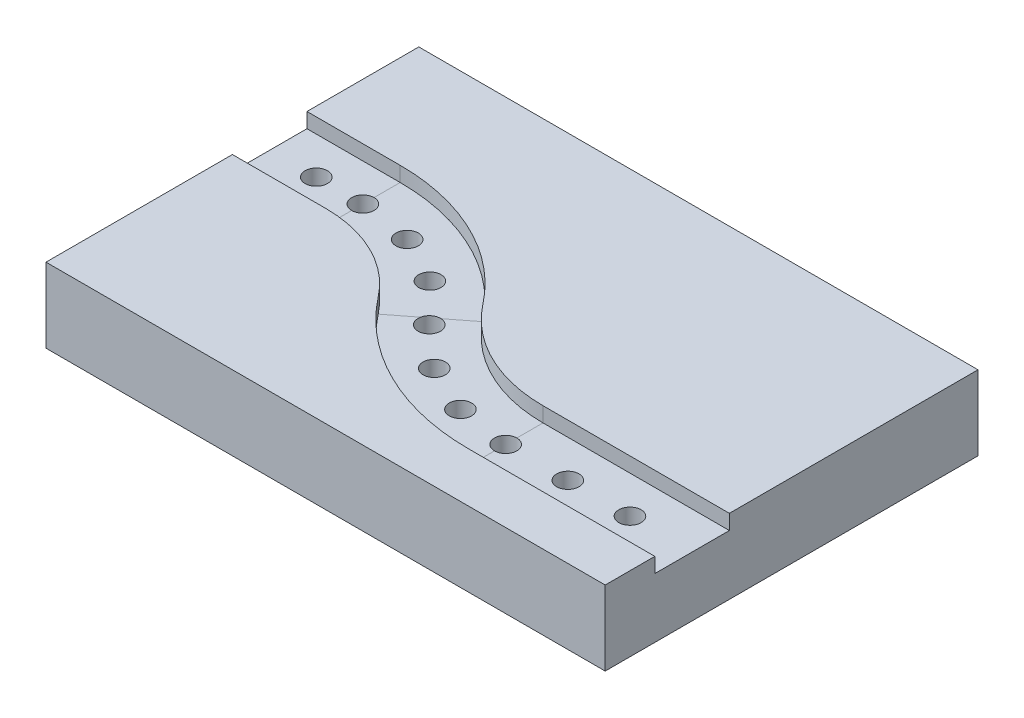
ISO-10303-21;
HEADER;
FILE_DESCRIPTION(('STEP AP214'),'2;1');
FILE_NAME('part.step','',(''),(''),'','','');
FILE_SCHEMA(('AUTOMOTIVE_DESIGN { 1 0 10303 214 1 1 1 1 }'));
ENDSEC;
DATA;
#1=APPLICATION_CONTEXT('core data for automotive mechanical design processes');
#2=APPLICATION_PROTOCOL_DEFINITION('international standard','automotive_design',2000,#1);
#3=PRODUCT_CONTEXT('',#1,'mechanical');
#4=PRODUCT('Part','Part','',(#3));
#5=PRODUCT_RELATED_PRODUCT_CATEGORY('part','',(#4));
#6=PRODUCT_DEFINITION_FORMATION('','',#4);
#7=PRODUCT_DEFINITION_CONTEXT('part definition',#1,'design');
#8=PRODUCT_DEFINITION('design','',#6,#7);
#9=PRODUCT_DEFINITION_SHAPE('','',#8);
#10=(LENGTH_UNIT() NAMED_UNIT(*) SI_UNIT(.MILLI.,.METRE.));
#11=(NAMED_UNIT(*) PLANE_ANGLE_UNIT() SI_UNIT($,.RADIAN.));
#12=(NAMED_UNIT(*) SI_UNIT($,.STERADIAN.) SOLID_ANGLE_UNIT());
#13=UNCERTAINTY_MEASURE_WITH_UNIT(LENGTH_MEASURE(1.E-05),#10,'distance_accuracy_value','');
#14=(GEOMETRIC_REPRESENTATION_CONTEXT(3) GLOBAL_UNCERTAINTY_ASSIGNED_CONTEXT((#13)) GLOBAL_UNIT_ASSIGNED_CONTEXT((#10,
#11,#12)) REPRESENTATION_CONTEXT('',''));
#15=CARTESIAN_POINT('',(0.,0.,0.));
#16=DIRECTION('',(0.,0.,1.));
#17=DIRECTION('',(1.,0.,0.));
#18=AXIS2_PLACEMENT_3D('',#15,#16,#17);
#19=CARTESIAN_POINT('',(0.,20.,0.));
#20=DIRECTION('',(0.,1.,0.));
#21=DIRECTION('',(0.,0.,1.));
#22=AXIS2_PLACEMENT_3D('',#19,#20,#21);
#23=PLANE('',#22);
#24=DIRECTION('',(0.,0.,-1.));
#25=VECTOR('',#24,1.);
#26=CARTESIAN_POINT('',(0.,20.,0.));
#27=LINE('',#26,#25);
#28=CARTESIAN_POINT('',(0.,20.,-70.));
#29=VERTEX_POINT('',#28);
#30=CARTESIAN_POINT('',(0.,20.,-100.));
#31=VERTEX_POINT('',#30);
#32=EDGE_CURVE('E265',#29,#31,#27,.T.);
#33=ORIENTED_EDGE('',*,*,#32,.F.);
#34=DIRECTION('',(1.,0.,0.));
#35=VECTOR('',#34,1.);
#36=CARTESIAN_POINT('',(0.,20.,-70.));
#37=LINE('',#36,#35);
#38=CARTESIAN_POINT('',(25.,20.,-70.));
#39=VERTEX_POINT('',#38);
#40=EDGE_CURVE('E74',#29,#39,#37,.T.);
#41=ORIENTED_EDGE('',*,*,#40,.T.);
#42=CARTESIAN_POINT('',(25.,20.,-15.));
#43=DIRECTION('',(0.,1.,0.));
#44=DIRECTION('',(0.,0.,1.));
#45=AXIS2_PLACEMENT_3D('',#42,#43,#44);
#46=CIRCLE('',#45,55.);
#47=CARTESIAN_POINT('',(68.4210526315789,20.,-48.7581425491043));
#48=VERTEX_POINT('',#47);
#49=EDGE_CURVE('E307',#39,#48,#46,.F.);
#50=ORIENTED_EDGE('',*,*,#49,.T.);
#51=CARTESIAN_POINT('',(100.,20.,-73.3095189484529));
#52=DIRECTION('',(0.,1.,0.));
#53=DIRECTION('',(0.,0.,1.));
#54=AXIS2_PLACEMENT_3D('',#51,#52,#53);
#55=CIRCLE('',#54,40.);
#56=CARTESIAN_POINT('',(100.,20.,-33.309518948453));
#57=VERTEX_POINT('',#56);
#58=EDGE_CURVE('E305',#48,#57,#55,.T.);
#59=ORIENTED_EDGE('',*,*,#58,.T.);
#60=DIRECTION('',(1.,0.,0.));
#61=VECTOR('',#60,1.);
#62=CARTESIAN_POINT('',(0.,20.,-33.309518948453));
#63=LINE('',#62,#61);
#64=CARTESIAN_POINT('',(150.,20.,-33.309518948453));
#65=VERTEX_POINT('',#64);
#66=EDGE_CURVE('E302',#57,#65,#63,.T.);
#67=ORIENTED_EDGE('',*,*,#66,.T.);
#68=DIRECTION('',(0.,0.,-1.));
#69=VECTOR('',#68,1.);
#70=CARTESIAN_POINT('',(150.,20.,0.));
#71=LINE('',#70,#69);
#72=CARTESIAN_POINT('',(150.,20.,-100.));
#73=VERTEX_POINT('',#72);
#74=EDGE_CURVE('E257',#65,#73,#71,.T.);
#75=ORIENTED_EDGE('',*,*,#74,.T.);
#76=DIRECTION('',(1.,0.,0.));
#77=VECTOR('',#76,1.);
#78=CARTESIAN_POINT('',(0.,20.,-100.));
#79=LINE('',#78,#77);
#80=EDGE_CURVE('E262',#31,#73,#79,.T.);
#81=ORIENTED_EDGE('',*,*,#80,.F.);
#82=EDGE_LOOP('',(#33,#41,#50,#59,#67,#75,#81));
#83=FACE_BOUND('',#82,.T.);
#84=ADVANCED_FACE('F70',(#83),#23,.T.);
#85=CARTESIAN_POINT('',(25.,20.,-15.));
#86=DIRECTION('',(0.,1.,0.));
#87=DIRECTION('',(0.,0.,1.));
#88=AXIS2_PLACEMENT_3D('',#85,#86,#87);
#89=CIRCLE('',#88,35.);
#90=CARTESIAN_POINT('',(52.6315789473684,20.,-36.48245434943));
#91=VERTEX_POINT('',#90);
#92=CARTESIAN_POINT('',(25.,20.,-50.));
#93=VERTEX_POINT('',#92);
#94=EDGE_CURVE('E296',#91,#93,#89,.T.);
#95=ORIENTED_EDGE('',*,*,#94,.T.);
#96=DIRECTION('',(-1.,0.,0.));
#97=VECTOR('',#96,1.);
#98=CARTESIAN_POINT('',(0.,20.,-50.));
#99=LINE('',#98,#97);
#100=CARTESIAN_POINT('',(0.,20.,-50.));
#101=VERTEX_POINT('',#100);
#102=EDGE_CURVE('E299',#93,#101,#99,.T.);
#103=ORIENTED_EDGE('',*,*,#102,.T.);
#104=CARTESIAN_POINT('',(0.,20.,0.));
#105=VERTEX_POINT('',#104);
#106=EDGE_CURVE('E266',#105,#101,#27,.T.);
#107=ORIENTED_EDGE('',*,*,#106,.F.);
#108=DIRECTION('',(1.,0.,0.));
#109=VECTOR('',#108,1.);
#110=CARTESIAN_POINT('',(0.,20.,0.));
#111=LINE('',#110,#109);
#112=CARTESIAN_POINT('',(150.,20.,0.));
#113=VERTEX_POINT('',#112);
#114=EDGE_CURVE('E254',#105,#113,#111,.T.);
#115=ORIENTED_EDGE('',*,*,#114,.T.);
#116=CARTESIAN_POINT('',(150.,20.,-13.309518948453));
#117=VERTEX_POINT('',#116);
#118=EDGE_CURVE('E259',#113,#117,#71,.T.);
#119=ORIENTED_EDGE('',*,*,#118,.T.);
#120=DIRECTION('',(-1.,0.,0.));
#121=VECTOR('',#120,1.);
#122=CARTESIAN_POINT('',(0.,20.,-13.309518948453));
#123=LINE('',#122,#121);
#124=CARTESIAN_POINT('',(100.,20.,-13.309518948453));
#125=VERTEX_POINT('',#124);
#126=EDGE_CURVE('E290',#117,#125,#123,.T.);
#127=ORIENTED_EDGE('',*,*,#126,.T.);
#128=CARTESIAN_POINT('',(100.,20.,-73.3095189484529));
#129=DIRECTION('',(0.,1.,0.));
#130=DIRECTION('',(0.,0.,1.));
#131=AXIS2_PLACEMENT_3D('',#128,#129,#130);
#132=CIRCLE('',#131,60.);
#133=EDGE_CURVE('E293',#125,#91,#132,.F.);
#134=ORIENTED_EDGE('',*,*,#133,.T.);
#135=EDGE_LOOP('',(#95,#103,#107,#115,#119,#127,#134));
#136=FACE_BOUND('',#135,.T.);
#137=ADVANCED_FACE('F374',(#136),#23,.T.);
#138=CARTESIAN_POINT('',(0.,20.,0.));
#139=DIRECTION('',(0.,0.,-1.));
#140=DIRECTION('',(-1.,0.,0.));
#141=AXIS2_PLACEMENT_3D('',#138,#139,#140);
#142=PLANE('',#141);
#143=DIRECTION('',(1.,0.,0.));
#144=VECTOR('',#143,1.);
#145=CARTESIAN_POINT('',(0.,0.,0.));
#146=LINE('',#145,#144);
#147=CARTESIAN_POINT('',(0.,0.,0.));
#148=VERTEX_POINT('',#147);
#149=CARTESIAN_POINT('',(150.,0.,0.));
#150=VERTEX_POINT('',#149);
#151=EDGE_CURVE('E270',#148,#150,#146,.T.);
#152=ORIENTED_EDGE('',*,*,#151,.T.);
#153=DIRECTION('',(0.,-1.,0.));
#154=VECTOR('',#153,1.);
#155=CARTESIAN_POINT('',(150.,20.,0.));
#156=LINE('',#155,#154);
#157=EDGE_CURVE('E287',#113,#150,#156,.T.);
#158=ORIENTED_EDGE('',*,*,#157,.F.);
#159=ORIENTED_EDGE('',*,*,#114,.F.);
#160=DIRECTION('',(0.,-1.,0.));
#161=VECTOR('',#160,1.);
#162=CARTESIAN_POINT('',(0.,20.,0.));
#163=LINE('',#162,#161);
#164=EDGE_CURVE('E269',#105,#148,#163,.T.);
#165=ORIENTED_EDGE('',*,*,#164,.T.);
#166=EDGE_LOOP('',(#152,#158,#159,#165));
#167=FACE_BOUND('',#166,.T.);
#168=ADVANCED_FACE('F72',(#167),#142,.F.);
#169=CARTESIAN_POINT('',(150.,20.,0.));
#170=DIRECTION('',(-1.,0.,0.));
#171=DIRECTION('',(0.,0.,1.));
#172=AXIS2_PLACEMENT_3D('',#169,#170,#171);
#173=PLANE('',#172);
#174=DIRECTION('',(0.,0.,1.));
#175=VECTOR('',#174,1.);
#176=CARTESIAN_POINT('',(150.,16.,-33.309518948453));
#177=LINE('',#176,#175);
#178=CARTESIAN_POINT('',(150.,16.,-33.309518948453));
#179=VERTEX_POINT('',#178);
#180=CARTESIAN_POINT('',(150.,16.,-13.309518948453));
#181=VERTEX_POINT('',#180);
#182=EDGE_CURVE('E357',#179,#181,#177,.T.);
#183=ORIENTED_EDGE('',*,*,#182,.T.);
#184=DIRECTION('',(0.,1.,0.));
#185=VECTOR('',#184,1.);
#186=CARTESIAN_POINT('',(150.,22.6475504867612,-13.309518948453));
#187=LINE('',#186,#185);
#188=EDGE_CURVE('E274',#181,#117,#187,.T.);
#189=ORIENTED_EDGE('',*,*,#188,.T.);
#190=ORIENTED_EDGE('',*,*,#118,.F.);
#191=ORIENTED_EDGE('',*,*,#157,.T.);
#192=DIRECTION('',(0.,0.,-1.));
#193=VECTOR('',#192,1.);
#194=CARTESIAN_POINT('',(150.,0.,0.));
#195=LINE('',#194,#193);
#196=CARTESIAN_POINT('',(150.,0.,-100.));
#197=VERTEX_POINT('',#196);
#198=EDGE_CURVE('E273',#150,#197,#195,.T.);
#199=ORIENTED_EDGE('',*,*,#198,.T.);
#200=DIRECTION('',(0.,-1.,0.));
#201=VECTOR('',#200,1.);
#202=CARTESIAN_POINT('',(150.,20.,-100.));
#203=LINE('',#202,#201);
#204=EDGE_CURVE('E285',#73,#197,#203,.T.);
#205=ORIENTED_EDGE('',*,*,#204,.F.);
#206=ORIENTED_EDGE('',*,*,#74,.F.);
#207=DIRECTION('',(0.,-1.,0.));
#208=VECTOR('',#207,1.);
#209=CARTESIAN_POINT('',(150.,22.6475504867612,-33.309518948453));
#210=LINE('',#209,#208);
#211=EDGE_CURVE('E244',#65,#179,#210,.T.);
#212=ORIENTED_EDGE('',*,*,#211,.T.);
#213=EDGE_LOOP('',(#183,#189,#190,#191,#199,#205,#206,#212));
#214=FACE_BOUND('',#213,.T.);
#215=ADVANCED_FACE('F363',(#214),#173,.F.);
#216=CARTESIAN_POINT('',(0.,20.,-100.));
#217=DIRECTION('',(0.,0.,-1.));
#218=DIRECTION('',(-1.,0.,0.));
#219=AXIS2_PLACEMENT_3D('',#216,#217,#218);
#220=PLANE('',#219);
#221=DIRECTION('',(1.,0.,0.));
#222=VECTOR('',#221,1.);
#223=CARTESIAN_POINT('',(0.,0.,-100.));
#224=LINE('',#223,#222);
#225=CARTESIAN_POINT('',(0.,0.,-100.));
#226=VERTEX_POINT('',#225);
#227=EDGE_CURVE('E277',#226,#197,#224,.T.);
#228=ORIENTED_EDGE('',*,*,#227,.F.);
#229=DIRECTION('',(0.,-1.,0.));
#230=VECTOR('',#229,1.);
#231=CARTESIAN_POINT('',(0.,20.,-100.));
#232=LINE('',#231,#230);
#233=EDGE_CURVE('E283',#31,#226,#232,.T.);
#234=ORIENTED_EDGE('',*,*,#233,.F.);
#235=ORIENTED_EDGE('',*,*,#80,.T.);
#236=ORIENTED_EDGE('',*,*,#204,.T.);
#237=EDGE_LOOP('',(#228,#234,#235,#236));
#238=FACE_BOUND('',#237,.T.);
#239=ADVANCED_FACE('F386',(#238),#220,.T.);
#240=CARTESIAN_POINT('',(0.,20.,0.));
#241=DIRECTION('',(-1.,0.,0.));
#242=DIRECTION('',(0.,0.,1.));
#243=AXIS2_PLACEMENT_3D('',#240,#241,#242);
#244=PLANE('',#243);
#245=DIRECTION('',(0.,-1.,0.));
#246=VECTOR('',#245,1.);
#247=CARTESIAN_POINT('',(0.,22.6475504867612,-70.));
#248=LINE('',#247,#246);
#249=CARTESIAN_POINT('',(0.,16.,-70.));
#250=VERTEX_POINT('',#249);
#251=EDGE_CURVE('E248',#29,#250,#248,.T.);
#252=ORIENTED_EDGE('',*,*,#251,.F.);
#253=ORIENTED_EDGE('',*,*,#32,.T.);
#254=ORIENTED_EDGE('',*,*,#233,.T.);
#255=DIRECTION('',(0.,0.,-1.));
#256=VECTOR('',#255,1.);
#257=CARTESIAN_POINT('',(0.,0.,0.));
#258=LINE('',#257,#256);
#259=EDGE_CURVE('E258',#148,#226,#258,.T.);
#260=ORIENTED_EDGE('',*,*,#259,.F.);
#261=ORIENTED_EDGE('',*,*,#164,.F.);
#262=ORIENTED_EDGE('',*,*,#106,.T.);
#263=DIRECTION('',(0.,1.,0.));
#264=VECTOR('',#263,1.);
#265=CARTESIAN_POINT('',(0.,22.6475504867612,-50.));
#266=LINE('',#265,#264);
#267=CARTESIAN_POINT('',(0.,16.,-50.));
#268=VERTEX_POINT('',#267);
#269=EDGE_CURVE('E242',#268,#101,#266,.T.);
#270=ORIENTED_EDGE('',*,*,#269,.F.);
#271=DIRECTION('',(0.,0.,1.));
#272=VECTOR('',#271,1.);
#273=CARTESIAN_POINT('',(0.,16.,-70.));
#274=LINE('',#273,#272);
#275=EDGE_CURVE('E245',#250,#268,#274,.T.);
#276=ORIENTED_EDGE('',*,*,#275,.F.);
#277=EDGE_LOOP('',(#252,#253,#254,#260,#261,#262,#270,#276));
#278=FACE_BOUND('',#277,.T.);
#279=ADVANCED_FACE('F320',(#278),#244,.T.);
#280=CARTESIAN_POINT('',(0.,0.,0.));
#281=DIRECTION('',(0.,1.,0.));
#282=DIRECTION('',(0.,0.,1.));
#283=AXIS2_PLACEMENT_3D('',#280,#281,#282);
#284=PLANE('',#283);
#285=CARTESIAN_POINT('',(116.666666666667,0.,-23.309518948453));
#286=DIRECTION('',(0.,1.,0.));
#287=DIRECTION('',(0.,0.,1.));
#288=AXIS2_PLACEMENT_3D('',#285,#286,#287);
#289=CIRCLE('',#288,2.99999999999999);
#290=CARTESIAN_POINT('',(116.666666666667,0.,-20.309518948453));
#291=VERTEX_POINT('',#290);
#292=EDGE_CURVE('E638',#291,#291,#289,.T.);
#293=ORIENTED_EDGE('',*,*,#292,.T.);
#294=EDGE_LOOP('',(#293));
#295=FACE_BOUND('',#294,.T.);
#296=CARTESIAN_POINT('',(133.333333333333,0.,-23.309518948453));
#297=DIRECTION('',(0.,1.,0.));
#298=DIRECTION('',(0.,0.,1.));
#299=AXIS2_PLACEMENT_3D('',#296,#297,#298);
#300=CIRCLE('',#299,2.99999999999998);
#301=CARTESIAN_POINT('',(133.333333333333,0.,-20.309518948453));
#302=VERTEX_POINT('',#301);
#303=EDGE_CURVE('E648',#302,#302,#300,.T.);
#304=ORIENTED_EDGE('',*,*,#303,.T.);
#305=EDGE_LOOP('',(#304));
#306=FACE_BOUND('',#305,.T.);
#307=CARTESIAN_POINT('',(12.5,0.,-60.));
#308=DIRECTION('',(0.,1.,0.));
#309=DIRECTION('',(0.,0.,1.));
#310=AXIS2_PLACEMENT_3D('',#307,#308,#309);
#311=CIRCLE('',#310,3.);
#312=CARTESIAN_POINT('',(12.5,0.,-57.));
#313=VERTEX_POINT('',#312);
#314=EDGE_CURVE('E651',#313,#313,#311,.T.);
#315=ORIENTED_EDGE('',*,*,#314,.T.);
#316=EDGE_LOOP('',(#315));
#317=FACE_BOUND('',#316,.T.);
#318=CARTESIAN_POINT('',(100.,0.,-23.309518948453));
#319=DIRECTION('',(0.,1.,0.));
#320=DIRECTION('',(0.,0.,1.));
#321=AXIS2_PLACEMENT_3D('',#318,#319,#320);
#322=CIRCLE('',#321,3.);
#323=CARTESIAN_POINT('',(100.,0.,-20.309518948453));
#324=VERTEX_POINT('',#323);
#325=EDGE_CURVE('E191',#324,#324,#322,.T.);
#326=ORIENTED_EDGE('',*,*,#325,.T.);
#327=EDGE_LOOP('',(#326));
#328=FACE_BOUND('',#327,.T.);
#329=CARTESIAN_POINT('',(85.7909951199552,0.,-25.3709730764841));
#330=DIRECTION('',(0.,1.,0.));
#331=DIRECTION('',(0.,0.,1.));
#332=AXIS2_PLACEMENT_3D('',#329,#330,#331);
#333=CIRCLE('',#332,3.);
#334=CARTESIAN_POINT('',(85.7909951199552,0.,-22.3709730764841));
#335=VERTEX_POINT('',#334);
#336=EDGE_CURVE('E661',#335,#335,#333,.T.);
#337=ORIENTED_EDGE('',*,*,#336,.T.);
#338=EDGE_LOOP('',(#337));
#339=FACE_BOUND('',#338,.T.);
#340=CARTESIAN_POINT('',(72.7536387105177,0.,-31.3853517356985));
#341=DIRECTION('',(0.,1.,0.));
#342=DIRECTION('',(0.,0.,1.));
#343=AXIS2_PLACEMENT_3D('',#340,#341,#342);
#344=CIRCLE('',#343,3.);
#345=CARTESIAN_POINT('',(72.7536387105177,0.,-28.3853517356985));
#346=VERTEX_POINT('',#345);
#347=EDGE_CURVE('E667',#346,#346,#344,.T.);
#348=ORIENTED_EDGE('',*,*,#347,.T.);
#349=EDGE_LOOP('',(#348));
#350=FACE_BOUND('',#349,.T.);
#351=CARTESIAN_POINT('',(61.9629672592415,0.,-40.8567202975129));
#352=DIRECTION('',(0.,1.,0.));
#353=DIRECTION('',(0.,0.,1.));
#354=AXIS2_PLACEMENT_3D('',#351,#352,#353);
#355=CIRCLE('',#354,3.);
#356=CARTESIAN_POINT('',(61.9629672592415,0.,-37.8567202975129));
#357=VERTEX_POINT('',#356);
#358=EDGE_CURVE('E670',#357,#357,#355,.T.);
#359=ORIENTED_EDGE('',*,*,#358,.T.);
#360=EDGE_LOOP('',(#359));
#361=FACE_BOUND('',#360,.T.);
#362=CARTESIAN_POINT('',(51.8859178089722,0.,-51.0852798737822));
#363=DIRECTION('',(0.,1.,0.));
#364=DIRECTION('',(0.,0.,1.));
#365=AXIS2_PLACEMENT_3D('',#362,#363,#364);
#366=CIRCLE('',#365,3.);
#367=CARTESIAN_POINT('',(51.8859178089722,0.,-48.0852798737822));
#368=VERTEX_POINT('',#367);
#369=EDGE_CURVE('E676',#368,#368,#366,.T.);
#370=ORIENTED_EDGE('',*,*,#369,.T.);
#371=EDGE_LOOP('',(#370));
#372=FACE_BOUND('',#371,.T.);
#373=CARTESIAN_POINT('',(39.1626693402021,0.,-57.7132157201972));
#374=DIRECTION('',(0.,1.,0.));
#375=DIRECTION('',(0.,0.,1.));
#376=AXIS2_PLACEMENT_3D('',#373,#374,#375);
#377=CIRCLE('',#376,3.);
#378=CARTESIAN_POINT('',(39.1626693402021,0.,-54.7132157201972));
#379=VERTEX_POINT('',#378);
#380=EDGE_CURVE('E682',#379,#379,#377,.T.);
#381=ORIENTED_EDGE('',*,*,#380,.T.);
#382=EDGE_LOOP('',(#381));
#383=FACE_BOUND('',#382,.T.);
#384=CARTESIAN_POINT('',(25.,0.,-60.));
#385=DIRECTION('',(0.,1.,0.));
#386=DIRECTION('',(0.,0.,1.));
#387=AXIS2_PLACEMENT_3D('',#384,#385,#386);
#388=CIRCLE('',#387,3.);
#389=CARTESIAN_POINT('',(25.,0.,-57.));
#390=VERTEX_POINT('',#389);
#391=EDGE_CURVE('E241',#390,#390,#388,.T.);
#392=ORIENTED_EDGE('',*,*,#391,.T.);
#393=EDGE_LOOP('',(#392));
#394=FACE_BOUND('',#393,.T.);
#395=ORIENTED_EDGE('',*,*,#151,.F.);
#396=ORIENTED_EDGE('',*,*,#259,.T.);
#397=ORIENTED_EDGE('',*,*,#227,.T.);
#398=ORIENTED_EDGE('',*,*,#198,.F.);
#399=EDGE_LOOP('',(#395,#396,#397,#398));
#400=FACE_BOUND('',#399,.T.);
#401=ADVANCED_FACE('F383',(#295,#306,#317,#328,#339,#350,#361,#372,#383,#394,#400),#284,.F.);
#402=CARTESIAN_POINT('',(-4.,22.6475504867612,-70.));
#403=DIRECTION('',(0.,0.,1.));
#404=DIRECTION('',(1.,0.,0.));
#405=AXIS2_PLACEMENT_3D('',#402,#403,#404);
#406=PLANE('',#405);
#407=ORIENTED_EDGE('',*,*,#251,.T.);
#408=DIRECTION('',(1.,0.,0.));
#409=VECTOR('',#408,1.);
#410=CARTESIAN_POINT('',(-4.,16.,-70.));
#411=LINE('',#410,#409);
#412=CARTESIAN_POINT('',(25.,16.,-70.));
#413=VERTEX_POINT('',#412);
#414=EDGE_CURVE('E240',#250,#413,#411,.T.);
#415=ORIENTED_EDGE('',*,*,#414,.T.);
#416=DIRECTION('',(0.,-1.,0.));
#417=VECTOR('',#416,1.);
#418=CARTESIAN_POINT('',(25.,22.6475504867612,-70.));
#419=LINE('',#418,#417);
#420=EDGE_CURVE('E238',#39,#413,#419,.T.);
#421=ORIENTED_EDGE('',*,*,#420,.F.);
#422=ORIENTED_EDGE('',*,*,#40,.F.);
#423=EDGE_LOOP('',(#407,#415,#421,#422));
#424=FACE_BOUND('',#423,.T.);
#425=ADVANCED_FACE('F316',(#424),#406,.T.);
#426=CARTESIAN_POINT('',(-4.,16.,-70.));
#427=DIRECTION('',(0.,1.,0.));
#428=DIRECTION('',(0.,0.,1.));
#429=AXIS2_PLACEMENT_3D('',#426,#427,#428);
#430=PLANE('',#429);
#431=CARTESIAN_POINT('',(12.5,16.,-60.));
#432=DIRECTION('',(0.,1.,0.));
#433=DIRECTION('',(0.,0.,1.));
#434=AXIS2_PLACEMENT_3D('',#431,#432,#433);
#435=CIRCLE('',#434,3.);
#436=CARTESIAN_POINT('',(12.5,16.,-57.));
#437=VERTEX_POINT('',#436);
#438=EDGE_CURVE('E202',#437,#437,#435,.T.);
#439=ORIENTED_EDGE('',*,*,#438,.F.);
#440=EDGE_LOOP('',(#439));
#441=FACE_BOUND('',#440,.T.);
#442=CARTESIAN_POINT('',(25.,16.,-60.));
#443=DIRECTION('',(0.,1.,0.));
#444=DIRECTION('',(0.,0.,1.));
#445=AXIS2_PLACEMENT_3D('',#442,#443,#444);
#446=CIRCLE('',#445,3.);
#447=CARTESIAN_POINT('',(25.,16.,-63.));
#448=VERTEX_POINT('',#447);
#449=CARTESIAN_POINT('',(25.,16.,-57.));
#450=VERTEX_POINT('',#449);
#451=EDGE_CURVE('E685',#448,#450,#446,.T.);
#452=ORIENTED_EDGE('',*,*,#451,.F.);
#453=DIRECTION('',(0.,0.,1.));
#454=VECTOR('',#453,1.);
#455=CARTESIAN_POINT('',(25.,16.,-70.));
#456=LINE('',#455,#454);
#457=EDGE_CURVE('E222',#413,#448,#456,.T.);
#458=ORIENTED_EDGE('',*,*,#457,.F.);
#459=ORIENTED_EDGE('',*,*,#414,.F.);
#460=ORIENTED_EDGE('',*,*,#275,.T.);
#461=DIRECTION('',(1.,0.,0.));
#462=VECTOR('',#461,1.);
#463=CARTESIAN_POINT('',(-4.,16.,-50.));
#464=LINE('',#463,#462);
#465=CARTESIAN_POINT('',(25.,16.,-50.));
#466=VERTEX_POINT('',#465);
#467=EDGE_CURVE('E225',#268,#466,#464,.T.);
#468=ORIENTED_EDGE('',*,*,#467,.T.);
#469=EDGE_CURVE('E226',#450,#466,#456,.T.);
#470=ORIENTED_EDGE('',*,*,#469,.F.);
#471=EDGE_LOOP('',(#452,#458,#459,#460,#468,#470));
#472=FACE_BOUND('',#471,.T.);
#473=ADVANCED_FACE('F325',(#441,#472),#430,.T.);
#474=CARTESIAN_POINT('',(-4.,22.6475504867612,-50.));
#475=DIRECTION('',(0.,0.,-1.));
#476=DIRECTION('',(-1.,0.,0.));
#477=AXIS2_PLACEMENT_3D('',#474,#475,#476);
#478=PLANE('',#477);
#479=DIRECTION('',(0.,1.,0.));
#480=VECTOR('',#479,1.);
#481=CARTESIAN_POINT('',(25.,22.6475504867612,-50.));
#482=LINE('',#481,#480);
#483=EDGE_CURVE('E237',#466,#93,#482,.T.);
#484=ORIENTED_EDGE('',*,*,#483,.F.);
#485=ORIENTED_EDGE('',*,*,#467,.F.);
#486=ORIENTED_EDGE('',*,*,#269,.T.);
#487=ORIENTED_EDGE('',*,*,#102,.F.);
#488=EDGE_LOOP('',(#484,#485,#486,#487));
#489=FACE_BOUND('',#488,.T.);
#490=ADVANCED_FACE('F350',(#489),#478,.T.);
#491=CARTESIAN_POINT('',(25.,20.,-15.));
#492=DIRECTION('',(0.,-1.,0.));
#493=DIRECTION('',(0.,0.,-1.));
#494=AXIS2_PLACEMENT_3D('',#491,#492,#493);
#495=CYLINDRICAL_SURFACE('',#494,55.);
#496=ORIENTED_EDGE('',*,*,#420,.T.);
#497=CARTESIAN_POINT('',(25.,16.,-15.));
#498=DIRECTION('',(0.,-1.,0.));
#499=DIRECTION('',(0.,0.,-1.));
#500=AXIS2_PLACEMENT_3D('',#497,#498,#499);
#501=CIRCLE('',#500,55.);
#502=CARTESIAN_POINT('',(68.4210526315789,16.,-48.7581425491043));
#503=VERTEX_POINT('',#502);
#504=EDGE_CURVE('E232',#413,#503,#501,.T.);
#505=ORIENTED_EDGE('',*,*,#504,.T.);
#506=DIRECTION('',(0.,-1.,0.));
#507=VECTOR('',#506,1.);
#508=CARTESIAN_POINT('',(68.4210526315789,22.6475504867612,-48.7581425491043));
#509=LINE('',#508,#507);
#510=EDGE_CURVE('E235',#48,#503,#509,.T.);
#511=ORIENTED_EDGE('',*,*,#510,.F.);
#512=ORIENTED_EDGE('',*,*,#49,.F.);
#513=EDGE_LOOP('',(#496,#505,#511,#512));
#514=FACE_BOUND('',#513,.T.);
#515=ADVANCED_FACE('F337',(#514),#495,.F.);
#516=CARTESIAN_POINT('',(25.,16.,-70.));
#517=DIRECTION('',(0.,1.,0.));
#518=DIRECTION('',(0.,0.,1.));
#519=AXIS2_PLACEMENT_3D('',#516,#517,#518);
#520=PLANE('',#519);
#521=CARTESIAN_POINT('',(61.9629672592415,16.,-40.8567202975129));
#522=DIRECTION('',(0.,1.,0.));
#523=DIRECTION('',(0.,0.,1.));
#524=AXIS2_PLACEMENT_3D('',#521,#522,#523);
#525=CIRCLE('',#524,3.);
#526=CARTESIAN_POINT('',(62.1118927945343,16.,-43.8530215482114));
#527=VERTEX_POINT('',#526);
#528=CARTESIAN_POINT('',(59.0224362898277,16.,-41.4510919135232));
#529=VERTEX_POINT('',#528);
#530=EDGE_CURVE('E80',#527,#529,#525,.T.);
#531=ORIENTED_EDGE('',*,*,#530,.F.);
#532=DIRECTION('',(-0.789473684210527,0.,0.613784409983716));
#533=VECTOR('',#532,1.);
#534=CARTESIAN_POINT('',(68.4210526315789,16.,-48.7581425491043));
#535=LINE('',#534,#533);
#536=EDGE_CURVE('E218',#503,#527,#535,.T.);
#537=ORIENTED_EDGE('',*,*,#536,.F.);
#538=ORIENTED_EDGE('',*,*,#504,.F.);
#539=ORIENTED_EDGE('',*,*,#457,.T.);
#540=EDGE_CURVE('E686',#450,#448,#446,.T.);
#541=ORIENTED_EDGE('',*,*,#540,.F.);
#542=ORIENTED_EDGE('',*,*,#469,.T.);
#543=CARTESIAN_POINT('',(25.,16.,-15.));
#544=DIRECTION('',(0.,-1.,0.));
#545=DIRECTION('',(0.,0.,-1.));
#546=AXIS2_PLACEMENT_3D('',#543,#544,#545);
#547=CIRCLE('',#546,35.);
#548=CARTESIAN_POINT('',(52.6315789473684,16.,-36.48245434943));
#549=VERTEX_POINT('',#548);
#550=EDGE_CURVE('E214',#466,#549,#547,.T.);
#551=ORIENTED_EDGE('',*,*,#550,.T.);
#552=EDGE_CURVE('E221',#529,#549,#535,.T.);
#553=ORIENTED_EDGE('',*,*,#552,.F.);
#554=EDGE_LOOP('',(#531,#537,#538,#539,#541,#542,#551,#553));
#555=FACE_BOUND('',#554,.T.);
#556=CARTESIAN_POINT('',(51.8859178089722,16.,-51.0852798737822));
#557=DIRECTION('',(0.,1.,0.));
#558=DIRECTION('',(0.,0.,1.));
#559=AXIS2_PLACEMENT_3D('',#556,#557,#558);
#560=CIRCLE('',#559,3.);
#561=CARTESIAN_POINT('',(51.8859178089722,16.,-48.0852798737822));
#562=VERTEX_POINT('',#561);
#563=EDGE_CURVE('E673',#562,#562,#560,.T.);
#564=ORIENTED_EDGE('',*,*,#563,.F.);
#565=EDGE_LOOP('',(#564));
#566=FACE_BOUND('',#565,.T.);
#567=CARTESIAN_POINT('',(39.1626693402021,16.,-57.7132157201972));
#568=DIRECTION('',(0.,1.,0.));
#569=DIRECTION('',(0.,0.,1.));
#570=AXIS2_PLACEMENT_3D('',#567,#568,#569);
#571=CIRCLE('',#570,3.);
#572=CARTESIAN_POINT('',(39.1626693402021,16.,-54.7132157201972));
#573=VERTEX_POINT('',#572);
#574=EDGE_CURVE('E679',#573,#573,#571,.T.);
#575=ORIENTED_EDGE('',*,*,#574,.F.);
#576=EDGE_LOOP('',(#575));
#577=FACE_BOUND('',#576,.T.);
#578=ADVANCED_FACE('F332',(#555,#566,#577),#520,.T.);
#579=CARTESIAN_POINT('',(25.,20.,-15.));
#580=DIRECTION('',(0.,-1.,0.));
#581=DIRECTION('',(0.,0.,-1.));
#582=AXIS2_PLACEMENT_3D('',#579,#580,#581);
#583=CYLINDRICAL_SURFACE('',#582,35.);
#584=DIRECTION('',(0.,1.,0.));
#585=VECTOR('',#584,1.);
#586=CARTESIAN_POINT('',(52.6315789473684,22.6475504867612,-36.48245434943));
#587=LINE('',#586,#585);
#588=EDGE_CURVE('E217',#549,#91,#587,.T.);
#589=ORIENTED_EDGE('',*,*,#588,.F.);
#590=ORIENTED_EDGE('',*,*,#550,.F.);
#591=ORIENTED_EDGE('',*,*,#483,.T.);
#592=ORIENTED_EDGE('',*,*,#94,.F.);
#593=EDGE_LOOP('',(#589,#590,#591,#592));
#594=FACE_BOUND('',#593,.T.);
#595=ADVANCED_FACE('F347',(#594),#583,.T.);
#596=CARTESIAN_POINT('',(100.,20.,-73.3095189484529));
#597=DIRECTION('',(0.,1.,0.));
#598=DIRECTION('',(0.,0.,1.));
#599=AXIS2_PLACEMENT_3D('',#596,#597,#598);
#600=CYLINDRICAL_SURFACE('',#599,40.);
#601=ORIENTED_EDGE('',*,*,#510,.T.);
#602=CARTESIAN_POINT('',(100.,16.,-73.3095189484529));
#603=DIRECTION('',(0.,1.,0.));
#604=DIRECTION('',(-0.789473684210527,0.,0.613784409983715));
#605=AXIS2_PLACEMENT_3D('',#602,#603,#604);
#606=CIRCLE('',#605,40.);
#607=CARTESIAN_POINT('',(100.,16.,-33.309518948453));
#608=VERTEX_POINT('',#607);
#609=EDGE_CURVE('E211',#503,#608,#606,.T.);
#610=ORIENTED_EDGE('',*,*,#609,.T.);
#611=DIRECTION('',(0.,-1.,0.));
#612=VECTOR('',#611,1.);
#613=CARTESIAN_POINT('',(100.,22.6475504867612,-33.309518948453));
#614=LINE('',#613,#612);
#615=EDGE_CURVE('E230',#57,#608,#614,.T.);
#616=ORIENTED_EDGE('',*,*,#615,.F.);
#617=ORIENTED_EDGE('',*,*,#58,.F.);
#618=EDGE_LOOP('',(#601,#610,#616,#617));
#619=FACE_BOUND('',#618,.T.);
#620=ADVANCED_FACE('F339',(#619),#600,.T.);
#621=CARTESIAN_POINT('',(68.421052631579,16.,-48.7581425491043));
#622=DIRECTION('',(0.,1.,0.));
#623=DIRECTION('',(0.,0.,1.));
#624=AXIS2_PLACEMENT_3D('',#621,#622,#623);
#625=PLANE('',#624);
#626=CARTESIAN_POINT('',(100.,16.,-23.309518948453));
#627=DIRECTION('',(0.,1.,0.));
#628=DIRECTION('',(0.,0.,1.));
#629=AXIS2_PLACEMENT_3D('',#626,#627,#628);
#630=CIRCLE('',#629,3.);
#631=CARTESIAN_POINT('',(100.,16.,-26.309518948453));
#632=VERTEX_POINT('',#631);
#633=CARTESIAN_POINT('',(100.,16.,-20.309518948453));
#634=VERTEX_POINT('',#633);
#635=EDGE_CURVE('E86',#632,#634,#630,.T.);
#636=ORIENTED_EDGE('',*,*,#635,.F.);
#637=DIRECTION('',(0.,0.,1.));
#638=VECTOR('',#637,1.);
#639=CARTESIAN_POINT('',(100.,16.,-33.309518948453));
#640=LINE('',#639,#638);
#641=EDGE_CURVE('E198',#608,#632,#640,.T.);
#642=ORIENTED_EDGE('',*,*,#641,.F.);
#643=ORIENTED_EDGE('',*,*,#609,.F.);
#644=ORIENTED_EDGE('',*,*,#536,.T.);
#645=EDGE_CURVE('E13',#529,#527,#525,.T.);
#646=ORIENTED_EDGE('',*,*,#645,.F.);
#647=ORIENTED_EDGE('',*,*,#552,.T.);
#648=CARTESIAN_POINT('',(100.,16.,-73.3095189484529));
#649=DIRECTION('',(0.,1.,0.));
#650=DIRECTION('',(-0.789473684210527,0.,0.613784409983715));
#651=AXIS2_PLACEMENT_3D('',#648,#649,#650);
#652=CIRCLE('',#651,60.);
#653=CARTESIAN_POINT('',(100.,16.,-13.3095189484529));
#654=VERTEX_POINT('',#653);
#655=EDGE_CURVE('E207',#549,#654,#652,.T.);
#656=ORIENTED_EDGE('',*,*,#655,.T.);
#657=EDGE_CURVE('E201',#634,#654,#640,.T.);
#658=ORIENTED_EDGE('',*,*,#657,.F.);
#659=EDGE_LOOP('',(#636,#642,#643,#644,#646,#647,#656,#658));
#660=FACE_BOUND('',#659,.T.);
#661=CARTESIAN_POINT('',(85.7909951199552,16.,-25.3709730764841));
#662=DIRECTION('',(0.,1.,0.));
#663=DIRECTION('',(0.,0.,1.));
#664=AXIS2_PLACEMENT_3D('',#661,#662,#663);
#665=CIRCLE('',#664,3.);
#666=CARTESIAN_POINT('',(85.7909951199552,16.,-22.3709730764841));
#667=VERTEX_POINT('',#666);
#668=EDGE_CURVE('E658',#667,#667,#665,.T.);
#669=ORIENTED_EDGE('',*,*,#668,.F.);
#670=EDGE_LOOP('',(#669));
#671=FACE_BOUND('',#670,.T.);
#672=CARTESIAN_POINT('',(72.7536387105177,16.,-31.3853517356985));
#673=DIRECTION('',(0.,1.,0.));
#674=DIRECTION('',(0.,0.,1.));
#675=AXIS2_PLACEMENT_3D('',#672,#673,#674);
#676=CIRCLE('',#675,3.);
#677=CARTESIAN_POINT('',(72.7536387105177,16.,-28.3853517356985));
#678=VERTEX_POINT('',#677);
#679=EDGE_CURVE('E664',#678,#678,#676,.T.);
#680=ORIENTED_EDGE('',*,*,#679,.F.);
#681=EDGE_LOOP('',(#680));
#682=FACE_BOUND('',#681,.T.);
#683=ADVANCED_FACE('F195',(#660,#671,#682),#625,.T.);
#684=CARTESIAN_POINT('',(100.,20.,-73.3095189484529));
#685=DIRECTION('',(0.,1.,0.));
#686=DIRECTION('',(0.,0.,1.));
#687=AXIS2_PLACEMENT_3D('',#684,#685,#686);
#688=CYLINDRICAL_SURFACE('',#687,60.);
#689=DIRECTION('',(0.,1.,0.));
#690=VECTOR('',#689,1.);
#691=CARTESIAN_POINT('',(100.,22.6475504867612,-13.309518948453));
#692=LINE('',#691,#690);
#693=EDGE_CURVE('E209',#654,#125,#692,.T.);
#694=ORIENTED_EDGE('',*,*,#693,.F.);
#695=ORIENTED_EDGE('',*,*,#655,.F.);
#696=ORIENTED_EDGE('',*,*,#588,.T.);
#697=ORIENTED_EDGE('',*,*,#133,.F.);
#698=EDGE_LOOP('',(#694,#695,#696,#697));
#699=FACE_BOUND('',#698,.T.);
#700=ADVANCED_FACE('F372',(#699),#688,.F.);
#701=CARTESIAN_POINT('',(100.,22.6475504867612,-33.309518948453));
#702=DIRECTION('',(0.,0.,1.));
#703=DIRECTION('',(1.,0.,0.));
#704=AXIS2_PLACEMENT_3D('',#701,#702,#703);
#705=PLANE('',#704);
#706=ORIENTED_EDGE('',*,*,#615,.T.);
#707=DIRECTION('',(1.,0.,0.));
#708=VECTOR('',#707,1.);
#709=CARTESIAN_POINT('',(100.,16.,-33.309518948453));
#710=LINE('',#709,#708);
#711=EDGE_CURVE('E206',#608,#179,#710,.T.);
#712=ORIENTED_EDGE('',*,*,#711,.T.);
#713=ORIENTED_EDGE('',*,*,#211,.F.);
#714=ORIENTED_EDGE('',*,*,#66,.F.);
#715=EDGE_LOOP('',(#706,#712,#713,#714));
#716=FACE_BOUND('',#715,.T.);
#717=ADVANCED_FACE('F388',(#716),#705,.T.);
#718=CARTESIAN_POINT('',(100.,16.,-33.309518948453));
#719=DIRECTION('',(0.,1.,0.));
#720=DIRECTION('',(0.,0.,1.));
#721=AXIS2_PLACEMENT_3D('',#718,#719,#720);
#722=PLANE('',#721);
#723=CARTESIAN_POINT('',(116.666666666667,16.,-23.309518948453));
#724=DIRECTION('',(0.,1.,0.));
#725=DIRECTION('',(0.,0.,1.));
#726=AXIS2_PLACEMENT_3D('',#723,#724,#725);
#727=CIRCLE('',#726,2.99999999999999);
#728=CARTESIAN_POINT('',(116.666666666667,16.,-20.309518948453));
#729=VERTEX_POINT('',#728);
#730=EDGE_CURVE('E641',#729,#729,#727,.T.);
#731=ORIENTED_EDGE('',*,*,#730,.F.);
#732=EDGE_LOOP('',(#731));
#733=FACE_BOUND('',#732,.T.);
#734=CARTESIAN_POINT('',(133.333333333333,16.,-23.309518948453));
#735=DIRECTION('',(0.,1.,0.));
#736=DIRECTION('',(0.,0.,1.));
#737=AXIS2_PLACEMENT_3D('',#734,#735,#736);
#738=CIRCLE('',#737,3.);
#739=CARTESIAN_POINT('',(133.333333333333,16.,-20.309518948453));
#740=VERTEX_POINT('',#739);
#741=EDGE_CURVE('E643',#740,#740,#738,.T.);
#742=ORIENTED_EDGE('',*,*,#741,.F.);
#743=EDGE_LOOP('',(#742));
#744=FACE_BOUND('',#743,.T.);
#745=EDGE_CURVE('E186',#634,#632,#630,.T.);
#746=ORIENTED_EDGE('',*,*,#745,.F.);
#747=ORIENTED_EDGE('',*,*,#657,.T.);
#748=DIRECTION('',(1.,0.,0.));
#749=VECTOR('',#748,1.);
#750=CARTESIAN_POINT('',(100.,16.,-13.309518948453));
#751=LINE('',#750,#749);
#752=EDGE_CURVE('E228',#654,#181,#751,.T.);
#753=ORIENTED_EDGE('',*,*,#752,.T.);
#754=ORIENTED_EDGE('',*,*,#182,.F.);
#755=ORIENTED_EDGE('',*,*,#711,.F.);
#756=ORIENTED_EDGE('',*,*,#641,.T.);
#757=EDGE_LOOP('',(#746,#747,#753,#754,#755,#756));
#758=FACE_BOUND('',#757,.T.);
#759=ADVANCED_FACE('F204',(#733,#744,#758),#722,.T.);
#760=CARTESIAN_POINT('',(100.,22.6475504867612,-13.309518948453));
#761=DIRECTION('',(0.,0.,-1.));
#762=DIRECTION('',(-1.,0.,0.));
#763=AXIS2_PLACEMENT_3D('',#760,#761,#762);
#764=PLANE('',#763);
#765=ORIENTED_EDGE('',*,*,#188,.F.);
#766=ORIENTED_EDGE('',*,*,#752,.F.);
#767=ORIENTED_EDGE('',*,*,#693,.T.);
#768=ORIENTED_EDGE('',*,*,#126,.F.);
#769=EDGE_LOOP('',(#765,#766,#767,#768));
#770=FACE_BOUND('',#769,.T.);
#771=ADVANCED_FACE('F370',(#770),#764,.T.);
#772=CARTESIAN_POINT('',(25.,16.,-60.));
#773=DIRECTION('',(0.,1.,0.));
#774=DIRECTION('',(0.,0.,1.));
#775=AXIS2_PLACEMENT_3D('',#772,#773,#774);
#776=CYLINDRICAL_SURFACE('',#775,3.);
#777=ORIENTED_EDGE('',*,*,#391,.F.);
#778=EDGE_LOOP('',(#777));
#779=FACE_BOUND('',#778,.T.);
#780=ORIENTED_EDGE('',*,*,#540,.T.);
#781=ORIENTED_EDGE('',*,*,#451,.T.);
#782=EDGE_LOOP('',(#780,#781));
#783=FACE_BOUND('',#782,.T.);
#784=ADVANCED_FACE('F468',(#779,#783),#776,.F.);
#785=CARTESIAN_POINT('',(39.1626693402021,16.,-57.7132157201972));
#786=DIRECTION('',(0.,1.,0.));
#787=DIRECTION('',(0.,0.,1.));
#788=AXIS2_PLACEMENT_3D('',#785,#786,#787);
#789=CYLINDRICAL_SURFACE('',#788,3.);
#790=ORIENTED_EDGE('',*,*,#380,.F.);
#791=EDGE_LOOP('',(#790));
#792=FACE_BOUND('',#791,.T.);
#793=ORIENTED_EDGE('',*,*,#574,.T.);
#794=EDGE_LOOP('',(#793));
#795=FACE_BOUND('',#794,.T.);
#796=ADVANCED_FACE('F514',(#792,#795),#789,.F.);
#797=CARTESIAN_POINT('',(51.8859178089722,16.,-51.0852798737822));
#798=DIRECTION('',(0.,1.,0.));
#799=DIRECTION('',(0.,0.,1.));
#800=AXIS2_PLACEMENT_3D('',#797,#798,#799);
#801=CYLINDRICAL_SURFACE('',#800,3.);
#802=ORIENTED_EDGE('',*,*,#369,.F.);
#803=EDGE_LOOP('',(#802));
#804=FACE_BOUND('',#803,.T.);
#805=ORIENTED_EDGE('',*,*,#563,.T.);
#806=EDGE_LOOP('',(#805));
#807=FACE_BOUND('',#806,.T.);
#808=ADVANCED_FACE('F535',(#804,#807),#801,.F.);
#809=CARTESIAN_POINT('',(61.9629672592415,16.,-40.8567202975129));
#810=DIRECTION('',(0.,1.,0.));
#811=DIRECTION('',(0.,0.,1.));
#812=AXIS2_PLACEMENT_3D('',#809,#810,#811);
#813=CYLINDRICAL_SURFACE('',#812,3.);
#814=ORIENTED_EDGE('',*,*,#358,.F.);
#815=EDGE_LOOP('',(#814));
#816=FACE_BOUND('',#815,.T.);
#817=ORIENTED_EDGE('',*,*,#530,.T.);
#818=ORIENTED_EDGE('',*,*,#645,.T.);
#819=EDGE_LOOP('',(#817,#818));
#820=FACE_BOUND('',#819,.T.);
#821=ADVANCED_FACE('F545',(#816,#820),#813,.F.);
#822=CARTESIAN_POINT('',(72.7536387105177,16.,-31.3853517356985));
#823=DIRECTION('',(0.,1.,0.));
#824=DIRECTION('',(0.,0.,1.));
#825=AXIS2_PLACEMENT_3D('',#822,#823,#824);
#826=CYLINDRICAL_SURFACE('',#825,3.);
#827=ORIENTED_EDGE('',*,*,#347,.F.);
#828=EDGE_LOOP('',(#827));
#829=FACE_BOUND('',#828,.T.);
#830=ORIENTED_EDGE('',*,*,#679,.T.);
#831=EDGE_LOOP('',(#830));
#832=FACE_BOUND('',#831,.T.);
#833=ADVANCED_FACE('F555',(#829,#832),#826,.F.);
#834=CARTESIAN_POINT('',(85.7909951199552,16.,-25.3709730764841));
#835=DIRECTION('',(0.,1.,0.));
#836=DIRECTION('',(0.,0.,1.));
#837=AXIS2_PLACEMENT_3D('',#834,#835,#836);
#838=CYLINDRICAL_SURFACE('',#837,3.);
#839=ORIENTED_EDGE('',*,*,#336,.F.);
#840=EDGE_LOOP('',(#839));
#841=FACE_BOUND('',#840,.T.);
#842=ORIENTED_EDGE('',*,*,#668,.T.);
#843=EDGE_LOOP('',(#842));
#844=FACE_BOUND('',#843,.T.);
#845=ADVANCED_FACE('F565',(#841,#844),#838,.F.);
#846=CARTESIAN_POINT('',(100.,16.,-23.309518948453));
#847=DIRECTION('',(0.,1.,0.));
#848=DIRECTION('',(0.,0.,1.));
#849=AXIS2_PLACEMENT_3D('',#846,#847,#848);
#850=CYLINDRICAL_SURFACE('',#849,3.);
#851=ORIENTED_EDGE('',*,*,#325,.F.);
#852=EDGE_LOOP('',(#851));
#853=FACE_BOUND('',#852,.T.);
#854=ORIENTED_EDGE('',*,*,#745,.T.);
#855=ORIENTED_EDGE('',*,*,#635,.T.);
#856=EDGE_LOOP('',(#854,#855));
#857=FACE_BOUND('',#856,.T.);
#858=ADVANCED_FACE('F187',(#853,#857),#850,.F.);
#859=CARTESIAN_POINT('',(12.5,16.,-60.));
#860=DIRECTION('',(0.,1.,0.));
#861=DIRECTION('',(0.,0.,1.));
#862=AXIS2_PLACEMENT_3D('',#859,#860,#861);
#863=CYLINDRICAL_SURFACE('',#862,3.);
#864=ORIENTED_EDGE('',*,*,#314,.F.);
#865=EDGE_LOOP('',(#864));
#866=FACE_BOUND('',#865,.T.);
#867=ORIENTED_EDGE('',*,*,#438,.T.);
#868=EDGE_LOOP('',(#867));
#869=FACE_BOUND('',#868,.T.);
#870=ADVANCED_FACE('F584',(#866,#869),#863,.F.);
#871=CARTESIAN_POINT('',(133.333333333333,16.,-23.309518948453));
#872=DIRECTION('',(0.,1.,0.));
#873=DIRECTION('',(0.,0.,1.));
#874=AXIS2_PLACEMENT_3D('',#871,#872,#873);
#875=CYLINDRICAL_SURFACE('',#874,2.99999999999999);
#876=ORIENTED_EDGE('',*,*,#303,.F.);
#877=EDGE_LOOP('',(#876));
#878=FACE_BOUND('',#877,.T.);
#879=ORIENTED_EDGE('',*,*,#741,.T.);
#880=EDGE_LOOP('',(#879));
#881=FACE_BOUND('',#880,.T.);
#882=ADVANCED_FACE('F600',(#878,#881),#875,.F.);
#883=CARTESIAN_POINT('',(116.666666666667,16.,-23.309518948453));
#884=DIRECTION('',(0.,1.,0.));
#885=DIRECTION('',(0.,0.,1.));
#886=AXIS2_PLACEMENT_3D('',#883,#884,#885);
#887=CYLINDRICAL_SURFACE('',#886,2.99999999999999);
#888=ORIENTED_EDGE('',*,*,#292,.F.);
#889=EDGE_LOOP('',(#888));
#890=FACE_BOUND('',#889,.T.);
#891=ORIENTED_EDGE('',*,*,#730,.T.);
#892=EDGE_LOOP('',(#891));
#893=FACE_BOUND('',#892,.T.);
#894=ADVANCED_FACE('F621',(#890,#893),#887,.F.);
#895=CLOSED_SHELL('',(#84,#137,#168,#215,#239,#279,#401,#425,#473,#490,#515,#578,#595,#620,#683,
#700,#717,#759,#771,#784,#796,#808,#821,#833,#845,#858,#870,#882,#894));
#896=MANIFOLD_SOLID_BREP('B2',#895);
#897=ADVANCED_BREP_SHAPE_REPRESENTATION('',(#18,#896),#14);
#898=SHAPE_DEFINITION_REPRESENTATION(#9,#897);
ENDSEC;
END-ISO-10303-21;
